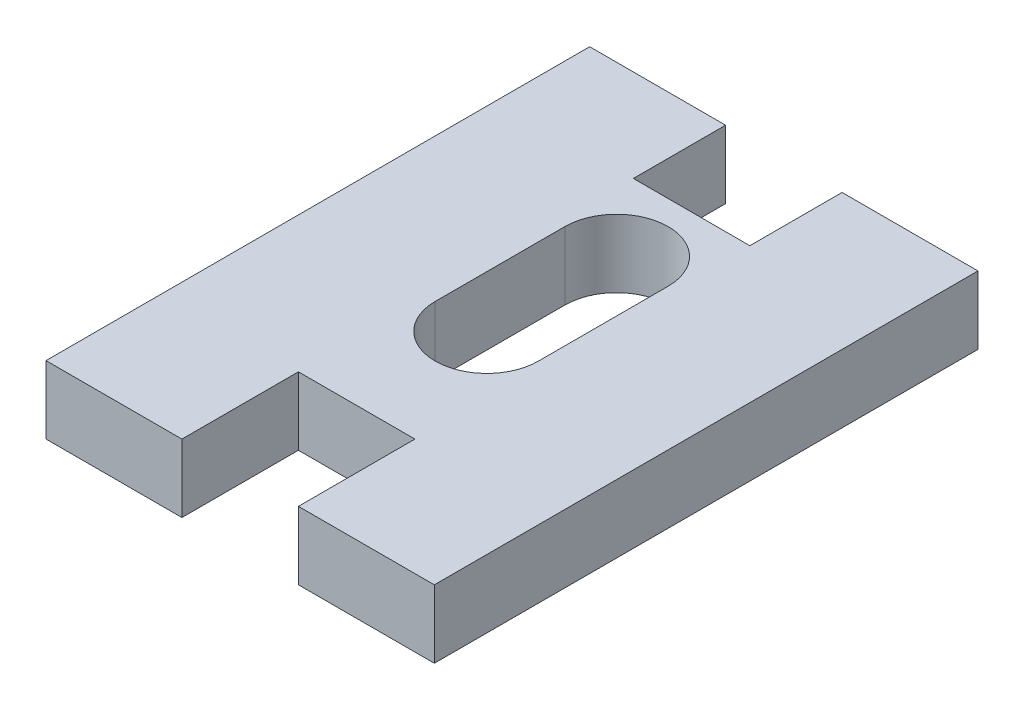
ISO-10303-21;
HEADER;
FILE_DESCRIPTION(('STEP AP214'),'2;1');
FILE_NAME('part.step','',(''),(''),'','','');
FILE_SCHEMA(('AUTOMOTIVE_DESIGN { 1 0 10303 214 1 1 1 1 }'));
ENDSEC;
DATA;
#1=APPLICATION_CONTEXT('core data for automotive mechanical design processes');
#2=APPLICATION_PROTOCOL_DEFINITION('international standard','automotive_design',2000,#1);
#3=PRODUCT_CONTEXT('',#1,'mechanical');
#4=PRODUCT('Part','Part','',(#3));
#5=PRODUCT_RELATED_PRODUCT_CATEGORY('part','',(#4));
#6=PRODUCT_DEFINITION_FORMATION('','',#4);
#7=PRODUCT_DEFINITION_CONTEXT('part definition',#1,'design');
#8=PRODUCT_DEFINITION('design','',#6,#7);
#9=PRODUCT_DEFINITION_SHAPE('','',#8);
#10=(LENGTH_UNIT() NAMED_UNIT(*) SI_UNIT(.MILLI.,.METRE.));
#11=(NAMED_UNIT(*) PLANE_ANGLE_UNIT() SI_UNIT($,.RADIAN.));
#12=(NAMED_UNIT(*) SI_UNIT($,.STERADIAN.) SOLID_ANGLE_UNIT());
#13=UNCERTAINTY_MEASURE_WITH_UNIT(LENGTH_MEASURE(1.E-05),#10,'distance_accuracy_value','');
#14=(GEOMETRIC_REPRESENTATION_CONTEXT(3) GLOBAL_UNCERTAINTY_ASSIGNED_CONTEXT((#13)) GLOBAL_UNIT_ASSIGNED_CONTEXT((#10,
#11,#12)) REPRESENTATION_CONTEXT('',''));
#15=CARTESIAN_POINT('',(0.,0.,0.));
#16=DIRECTION('',(0.,0.,1.));
#17=DIRECTION('',(1.,0.,0.));
#18=AXIS2_PLACEMENT_3D('',#15,#16,#17);
#19=CARTESIAN_POINT('',(0.,3.5,0.));
#20=DIRECTION('',(0.,0.,-1.));
#21=DIRECTION('',(-1.,0.,0.));
#22=AXIS2_PLACEMENT_3D('',#19,#20,#21);
#23=PLANE('',#22);
#24=DIRECTION('',(1.,0.,0.));
#25=VECTOR('',#24,1.);
#26=CARTESIAN_POINT('',(0.,0.,0.));
#27=LINE('',#26,#25);
#28=CARTESIAN_POINT('',(0.,0.,0.));
#29=VERTEX_POINT('',#28);
#30=CARTESIAN_POINT('',(7.,0.,0.));
#31=VERTEX_POINT('',#30);
#32=EDGE_CURVE('E297',#29,#31,#27,.T.);
#33=ORIENTED_EDGE('',*,*,#32,.T.);
#34=DIRECTION('',(0.,1.,0.));
#35=VECTOR('',#34,1.);
#36=CARTESIAN_POINT('',(7.,0.,0.));
#37=LINE('',#36,#35);
#38=CARTESIAN_POINT('',(7.,3.5,0.));
#39=VERTEX_POINT('',#38);
#40=EDGE_CURVE('E253',#31,#39,#37,.T.);
#41=ORIENTED_EDGE('',*,*,#40,.T.);
#42=DIRECTION('',(1.,0.,0.));
#43=VECTOR('',#42,1.);
#44=CARTESIAN_POINT('',(0.,3.5,0.));
#45=LINE('',#44,#43);
#46=CARTESIAN_POINT('',(0.,3.5,0.));
#47=VERTEX_POINT('',#46);
#48=EDGE_CURVE('E280',#47,#39,#45,.T.);
#49=ORIENTED_EDGE('',*,*,#48,.F.);
#50=DIRECTION('',(0.,-1.,0.));
#51=VECTOR('',#50,1.);
#52=CARTESIAN_POINT('',(0.,3.5,0.));
#53=LINE('',#52,#51);
#54=EDGE_CURVE('E11',#47,#29,#53,.T.);
#55=ORIENTED_EDGE('',*,*,#54,.T.);
#56=EDGE_LOOP('',(#33,#41,#49,#55));
#57=FACE_BOUND('',#56,.T.);
#58=ADVANCED_FACE('F39',(#57),#23,.F.);
#59=CARTESIAN_POINT('',(0.,3.5,-28.));
#60=DIRECTION('',(0.,0.,1.));
#61=DIRECTION('',(1.,0.,0.));
#62=AXIS2_PLACEMENT_3D('',#59,#60,#61);
#63=PLANE('',#62);
#64=DIRECTION('',(-1.,0.,0.));
#65=VECTOR('',#64,1.);
#66=CARTESIAN_POINT('',(0.,3.5,-28.));
#67=LINE('',#66,#65);
#68=CARTESIAN_POINT('',(7.,3.5,-28.));
#69=VERTEX_POINT('',#68);
#70=CARTESIAN_POINT('',(0.,3.5,-28.));
#71=VERTEX_POINT('',#70);
#72=EDGE_CURVE('E287',#69,#71,#67,.T.);
#73=ORIENTED_EDGE('',*,*,#72,.F.);
#74=DIRECTION('',(0.,1.,0.));
#75=VECTOR('',#74,1.);
#76=CARTESIAN_POINT('',(7.,0.,-28.));
#77=LINE('',#76,#75);
#78=CARTESIAN_POINT('',(7.,0.,-28.));
#79=VERTEX_POINT('',#78);
#80=EDGE_CURVE('E227',#79,#69,#77,.T.);
#81=ORIENTED_EDGE('',*,*,#80,.F.);
#82=DIRECTION('',(-1.,0.,0.));
#83=VECTOR('',#82,1.);
#84=CARTESIAN_POINT('',(0.,0.,-28.));
#85=LINE('',#84,#83);
#86=CARTESIAN_POINT('',(0.,0.,-28.));
#87=VERTEX_POINT('',#86);
#88=EDGE_CURVE('E304',#79,#87,#85,.T.);
#89=ORIENTED_EDGE('',*,*,#88,.T.);
#90=DIRECTION('',(0.,-1.,0.));
#91=VECTOR('',#90,1.);
#92=CARTESIAN_POINT('',(0.,3.5,-28.));
#93=LINE('',#92,#91);
#94=EDGE_CURVE('E292',#71,#87,#93,.T.);
#95=ORIENTED_EDGE('',*,*,#94,.F.);
#96=EDGE_LOOP('',(#73,#81,#89,#95));
#97=FACE_BOUND('',#96,.T.);
#98=ADVANCED_FACE('F360',(#97),#63,.F.);
#99=CARTESIAN_POINT('',(0.,3.5,0.));
#100=DIRECTION('',(1.,0.,0.));
#101=DIRECTION('',(0.,0.,-1.));
#102=AXIS2_PLACEMENT_3D('',#99,#100,#101);
#103=PLANE('',#102);
#104=DIRECTION('',(0.,0.,1.));
#105=VECTOR('',#104,1.);
#106=CARTESIAN_POINT('',(0.,0.,0.));
#107=LINE('',#106,#105);
#108=EDGE_CURVE('E230',#87,#29,#107,.T.);
#109=ORIENTED_EDGE('',*,*,#108,.T.);
#110=ORIENTED_EDGE('',*,*,#54,.F.);
#111=DIRECTION('',(0.,0.,1.));
#112=VECTOR('',#111,1.);
#113=CARTESIAN_POINT('',(0.,3.5,0.));
#114=LINE('',#113,#112);
#115=EDGE_CURVE('E274',#71,#47,#114,.T.);
#116=ORIENTED_EDGE('',*,*,#115,.F.);
#117=ORIENTED_EDGE('',*,*,#94,.T.);
#118=EDGE_LOOP('',(#109,#110,#116,#117));
#119=FACE_BOUND('',#118,.T.);
#120=ADVANCED_FACE('F41',(#119),#103,.F.);
#121=CARTESIAN_POINT('',(13.,3.5,0.));
#122=VERTEX_POINT('',#121);
#123=CARTESIAN_POINT('',(20.,3.5,0.));
#124=VERTEX_POINT('',#123);
#125=EDGE_CURVE('E278',#122,#124,#45,.T.);
#126=ORIENTED_EDGE('',*,*,#125,.F.);
#127=DIRECTION('',(0.,1.,0.));
#128=VECTOR('',#127,1.);
#129=CARTESIAN_POINT('',(13.,0.,0.));
#130=LINE('',#129,#128);
#131=CARTESIAN_POINT('',(13.,0.,0.));
#132=VERTEX_POINT('',#131);
#133=EDGE_CURVE('E268',#132,#122,#130,.T.);
#134=ORIENTED_EDGE('',*,*,#133,.F.);
#135=CARTESIAN_POINT('',(20.,0.,0.));
#136=VERTEX_POINT('',#135);
#137=EDGE_CURVE('E296',#132,#136,#27,.T.);
#138=ORIENTED_EDGE('',*,*,#137,.T.);
#139=DIRECTION('',(0.,-1.,0.));
#140=VECTOR('',#139,1.);
#141=CARTESIAN_POINT('',(20.,3.5,0.));
#142=LINE('',#141,#140);
#143=EDGE_CURVE('E48',#124,#136,#142,.T.);
#144=ORIENTED_EDGE('',*,*,#143,.F.);
#145=EDGE_LOOP('',(#126,#134,#138,#144));
#146=FACE_BOUND('',#145,.T.);
#147=ADVANCED_FACE('F339',(#146),#23,.F.);
#148=CARTESIAN_POINT('',(20.,3.5,0.));
#149=DIRECTION('',(-1.,0.,0.));
#150=DIRECTION('',(0.,0.,1.));
#151=AXIS2_PLACEMENT_3D('',#148,#149,#150);
#152=PLANE('',#151);
#153=DIRECTION('',(0.,0.,-1.));
#154=VECTOR('',#153,1.);
#155=CARTESIAN_POINT('',(20.,0.,0.));
#156=LINE('',#155,#154);
#157=CARTESIAN_POINT('',(20.,0.,-28.));
#158=VERTEX_POINT('',#157);
#159=EDGE_CURVE('E301',#136,#158,#156,.T.);
#160=ORIENTED_EDGE('',*,*,#159,.T.);
#161=DIRECTION('',(0.,-1.,0.));
#162=VECTOR('',#161,1.);
#163=CARTESIAN_POINT('',(20.,3.5,-28.));
#164=LINE('',#163,#162);
#165=CARTESIAN_POINT('',(20.,3.5,-28.));
#166=VERTEX_POINT('',#165);
#167=EDGE_CURVE('E311',#166,#158,#164,.T.);
#168=ORIENTED_EDGE('',*,*,#167,.F.);
#169=DIRECTION('',(0.,0.,-1.));
#170=VECTOR('',#169,1.);
#171=CARTESIAN_POINT('',(20.,3.5,0.));
#172=LINE('',#171,#170);
#173=EDGE_CURVE('E284',#124,#166,#172,.T.);
#174=ORIENTED_EDGE('',*,*,#173,.F.);
#175=ORIENTED_EDGE('',*,*,#143,.T.);
#176=EDGE_LOOP('',(#160,#168,#174,#175));
#177=FACE_BOUND('',#176,.T.);
#178=ADVANCED_FACE('F320',(#177),#152,.F.);
#179=CARTESIAN_POINT('',(13.,0.,-28.));
#180=VERTEX_POINT('',#179);
#181=EDGE_CURVE('E279',#158,#180,#85,.T.);
#182=ORIENTED_EDGE('',*,*,#181,.T.);
#183=DIRECTION('',(0.,1.,0.));
#184=VECTOR('',#183,1.);
#185=CARTESIAN_POINT('',(13.,0.,-28.));
#186=LINE('',#185,#184);
#187=CARTESIAN_POINT('',(13.,3.5,-28.));
#188=VERTEX_POINT('',#187);
#189=EDGE_CURVE('E231',#180,#188,#186,.T.);
#190=ORIENTED_EDGE('',*,*,#189,.T.);
#191=EDGE_CURVE('E288',#166,#188,#67,.T.);
#192=ORIENTED_EDGE('',*,*,#191,.F.);
#193=ORIENTED_EDGE('',*,*,#167,.T.);
#194=EDGE_LOOP('',(#182,#190,#192,#193));
#195=FACE_BOUND('',#194,.T.);
#196=ADVANCED_FACE('F327',(#195),#63,.F.);
#197=CARTESIAN_POINT('',(0.,3.5,0.));
#198=DIRECTION('',(0.,-1.,0.));
#199=DIRECTION('',(0.,0.,-1.));
#200=AXIS2_PLACEMENT_3D('',#197,#198,#199);
#201=PLANE('',#200);
#202=DIRECTION('',(0.,0.,1.));
#203=VECTOR('',#202,1.);
#204=CARTESIAN_POINT('',(7.38297531585007,3.5,-19.34));
#205=LINE('',#204,#203);
#206=CARTESIAN_POINT('',(7.38297531585007,3.5,-19.34));
#207=VERTEX_POINT('',#206);
#208=CARTESIAN_POINT('',(7.38297531585007,3.5,-12.66));
#209=VERTEX_POINT('',#208);
#210=EDGE_CURVE('E187',#207,#209,#205,.T.);
#211=ORIENTED_EDGE('',*,*,#210,.F.);
#212=CARTESIAN_POINT('',(10.0429753158501,3.5,-19.34));
#213=DIRECTION('',(0.,1.,0.));
#214=DIRECTION('',(0.,0.,1.));
#215=AXIS2_PLACEMENT_3D('',#212,#213,#214);
#216=CIRCLE('',#215,2.66);
#217=CARTESIAN_POINT('',(12.7029753158501,3.5,-19.34));
#218=VERTEX_POINT('',#217);
#219=EDGE_CURVE('E55',#218,#207,#216,.T.);
#220=ORIENTED_EDGE('',*,*,#219,.F.);
#221=DIRECTION('',(0.,0.,-1.));
#222=VECTOR('',#221,1.);
#223=CARTESIAN_POINT('',(12.7029753158501,3.5,-19.34));
#224=LINE('',#223,#222);
#225=CARTESIAN_POINT('',(12.7029753158501,3.5,-12.66));
#226=VERTEX_POINT('',#225);
#227=EDGE_CURVE('E174',#226,#218,#224,.T.);
#228=ORIENTED_EDGE('',*,*,#227,.F.);
#229=CARTESIAN_POINT('',(10.0429753158501,3.5,-12.66));
#230=DIRECTION('',(0.,1.,0.));
#231=DIRECTION('',(0.,0.,1.));
#232=AXIS2_PLACEMENT_3D('',#229,#230,#231);
#233=CIRCLE('',#232,2.66);
#234=EDGE_CURVE('E178',#209,#226,#233,.T.);
#235=ORIENTED_EDGE('',*,*,#234,.F.);
#236=EDGE_LOOP('',(#211,#220,#228,#235));
#237=FACE_BOUND('',#236,.T.);
#238=DIRECTION('',(1.,0.,0.));
#239=VECTOR('',#238,1.);
#240=CARTESIAN_POINT('',(7.,3.5,-23.25));
#241=LINE('',#240,#239);
#242=CARTESIAN_POINT('',(7.,3.5,-23.25));
#243=VERTEX_POINT('',#242);
#244=CARTESIAN_POINT('',(13.,3.5,-23.25));
#245=VERTEX_POINT('',#244);
#246=EDGE_CURVE('E220',#243,#245,#241,.T.);
#247=ORIENTED_EDGE('',*,*,#246,.F.);
#248=DIRECTION('',(0.,0.,1.));
#249=VECTOR('',#248,1.);
#250=CARTESIAN_POINT('',(7.,3.5,-28.));
#251=LINE('',#250,#249);
#252=EDGE_CURVE('E216',#69,#243,#251,.T.);
#253=ORIENTED_EDGE('',*,*,#252,.F.);
#254=ORIENTED_EDGE('',*,*,#72,.T.);
#255=ORIENTED_EDGE('',*,*,#115,.T.);
#256=ORIENTED_EDGE('',*,*,#48,.T.);
#257=DIRECTION('',(0.,0.,1.));
#258=VECTOR('',#257,1.);
#259=CARTESIAN_POINT('',(7.,3.5,0.));
#260=LINE('',#259,#258);
#261=CARTESIAN_POINT('',(7.,3.5,-6.));
#262=VERTEX_POINT('',#261);
#263=EDGE_CURVE('E196',#262,#39,#260,.T.);
#264=ORIENTED_EDGE('',*,*,#263,.F.);
#265=DIRECTION('',(-1.,0.,0.));
#266=VECTOR('',#265,1.);
#267=CARTESIAN_POINT('',(7.,3.5,-6.));
#268=LINE('',#267,#266);
#269=CARTESIAN_POINT('',(13.,3.5,-6.));
#270=VERTEX_POINT('',#269);
#271=EDGE_CURVE('E245',#270,#262,#268,.T.);
#272=ORIENTED_EDGE('',*,*,#271,.F.);
#273=DIRECTION('',(0.,0.,-1.));
#274=VECTOR('',#273,1.);
#275=CARTESIAN_POINT('',(13.,3.5,0.));
#276=LINE('',#275,#274);
#277=EDGE_CURVE('E256',#122,#270,#276,.T.);
#278=ORIENTED_EDGE('',*,*,#277,.F.);
#279=ORIENTED_EDGE('',*,*,#125,.T.);
#280=ORIENTED_EDGE('',*,*,#173,.T.);
#281=ORIENTED_EDGE('',*,*,#191,.T.);
#282=DIRECTION('',(0.,0.,-1.));
#283=VECTOR('',#282,1.);
#284=CARTESIAN_POINT('',(13.,3.5,-28.));
#285=LINE('',#284,#283);
#286=EDGE_CURVE('E207',#245,#188,#285,.T.);
#287=ORIENTED_EDGE('',*,*,#286,.F.);
#288=EDGE_LOOP('',(#247,#253,#254,#255,#256,#264,#272,#278,#279,#280,#281,#287));
#289=FACE_BOUND('',#288,.T.);
#290=ADVANCED_FACE('F332',(#237,#289),#201,.F.);
#291=CARTESIAN_POINT('',(0.,0.,0.));
#292=DIRECTION('',(0.,-1.,0.));
#293=DIRECTION('',(0.,0.,-1.));
#294=AXIS2_PLACEMENT_3D('',#291,#292,#293);
#295=PLANE('',#294);
#296=CARTESIAN_POINT('',(10.0429753158501,0.,-19.34));
#297=DIRECTION('',(0.,1.,0.));
#298=DIRECTION('',(0.,0.,1.));
#299=AXIS2_PLACEMENT_3D('',#296,#297,#298);
#300=CIRCLE('',#299,2.66);
#301=CARTESIAN_POINT('',(12.7029753158501,0.,-19.34));
#302=VERTEX_POINT('',#301);
#303=CARTESIAN_POINT('',(7.38297531585007,0.,-19.34));
#304=VERTEX_POINT('',#303);
#305=EDGE_CURVE('E155',#302,#304,#300,.T.);
#306=ORIENTED_EDGE('',*,*,#305,.T.);
#307=DIRECTION('',(0.,0.,1.));
#308=VECTOR('',#307,1.);
#309=CARTESIAN_POINT('',(7.38297531585007,0.,-19.34));
#310=LINE('',#309,#308);
#311=CARTESIAN_POINT('',(7.38297531585007,0.,-12.66));
#312=VERTEX_POINT('',#311);
#313=EDGE_CURVE('E165',#304,#312,#310,.T.);
#314=ORIENTED_EDGE('',*,*,#313,.T.);
#315=CARTESIAN_POINT('',(10.0429753158501,0.,-12.66));
#316=DIRECTION('',(0.,1.,0.));
#317=DIRECTION('',(0.,0.,1.));
#318=AXIS2_PLACEMENT_3D('',#315,#316,#317);
#319=CIRCLE('',#318,2.66);
#320=CARTESIAN_POINT('',(12.7029753158501,0.,-12.66));
#321=VERTEX_POINT('',#320);
#322=EDGE_CURVE('E63',#312,#321,#319,.T.);
#323=ORIENTED_EDGE('',*,*,#322,.T.);
#324=DIRECTION('',(0.,0.,-1.));
#325=VECTOR('',#324,1.);
#326=CARTESIAN_POINT('',(12.7029753158501,0.,-19.34));
#327=LINE('',#326,#325);
#328=EDGE_CURVE('E162',#321,#302,#327,.T.);
#329=ORIENTED_EDGE('',*,*,#328,.T.);
#330=EDGE_LOOP('',(#306,#314,#323,#329));
#331=FACE_BOUND('',#330,.T.);
#332=DIRECTION('',(0.,0.,1.));
#333=VECTOR('',#332,1.);
#334=CARTESIAN_POINT('',(7.,0.,-28.));
#335=LINE('',#334,#333);
#336=CARTESIAN_POINT('',(7.,0.,-23.25));
#337=VERTEX_POINT('',#336);
#338=EDGE_CURVE('E202',#79,#337,#335,.T.);
#339=ORIENTED_EDGE('',*,*,#338,.T.);
#340=DIRECTION('',(1.,0.,0.));
#341=VECTOR('',#340,1.);
#342=CARTESIAN_POINT('',(7.,0.,-23.25));
#343=LINE('',#342,#341);
#344=CARTESIAN_POINT('',(13.,0.,-23.25));
#345=VERTEX_POINT('',#344);
#346=EDGE_CURVE('E206',#337,#345,#343,.T.);
#347=ORIENTED_EDGE('',*,*,#346,.T.);
#348=DIRECTION('',(0.,0.,-1.));
#349=VECTOR('',#348,1.);
#350=CARTESIAN_POINT('',(13.,0.,-28.));
#351=LINE('',#350,#349);
#352=EDGE_CURVE('E211',#345,#180,#351,.T.);
#353=ORIENTED_EDGE('',*,*,#352,.T.);
#354=ORIENTED_EDGE('',*,*,#181,.F.);
#355=ORIENTED_EDGE('',*,*,#159,.F.);
#356=ORIENTED_EDGE('',*,*,#137,.F.);
#357=DIRECTION('',(0.,0.,-1.));
#358=VECTOR('',#357,1.);
#359=CARTESIAN_POINT('',(13.,0.,0.));
#360=LINE('',#359,#358);
#361=CARTESIAN_POINT('',(13.,0.,-6.));
#362=VERTEX_POINT('',#361);
#363=EDGE_CURVE('E244',#132,#362,#360,.T.);
#364=ORIENTED_EDGE('',*,*,#363,.T.);
#365=DIRECTION('',(-1.,0.,0.));
#366=VECTOR('',#365,1.);
#367=CARTESIAN_POINT('',(7.,0.,-6.));
#368=LINE('',#367,#366);
#369=CARTESIAN_POINT('',(7.,0.,-6.));
#370=VERTEX_POINT('',#369);
#371=EDGE_CURVE('E249',#362,#370,#368,.T.);
#372=ORIENTED_EDGE('',*,*,#371,.T.);
#373=DIRECTION('',(0.,0.,1.));
#374=VECTOR('',#373,1.);
#375=CARTESIAN_POINT('',(7.,0.,0.));
#376=LINE('',#375,#374);
#377=EDGE_CURVE('E240',#370,#31,#376,.T.);
#378=ORIENTED_EDGE('',*,*,#377,.T.);
#379=ORIENTED_EDGE('',*,*,#32,.F.);
#380=ORIENTED_EDGE('',*,*,#108,.F.);
#381=ORIENTED_EDGE('',*,*,#88,.F.);
#382=EDGE_LOOP('',(#339,#347,#353,#354,#355,#356,#364,#372,#378,#379,#380,#381));
#383=FACE_BOUND('',#382,.T.);
#384=ADVANCED_FACE('F170',(#331,#383),#295,.T.);
#385=CARTESIAN_POINT('',(7.,0.,0.));
#386=DIRECTION('',(-1.,0.,0.));
#387=DIRECTION('',(0.,0.,1.));
#388=AXIS2_PLACEMENT_3D('',#385,#386,#387);
#389=PLANE('',#388);
#390=ORIENTED_EDGE('',*,*,#263,.T.);
#391=ORIENTED_EDGE('',*,*,#40,.F.);
#392=ORIENTED_EDGE('',*,*,#377,.F.);
#393=DIRECTION('',(0.,1.,0.));
#394=VECTOR('',#393,1.);
#395=CARTESIAN_POINT('',(7.,0.,-6.));
#396=LINE('',#395,#394);
#397=EDGE_CURVE('E221',#370,#262,#396,.T.);
#398=ORIENTED_EDGE('',*,*,#397,.T.);
#399=EDGE_LOOP('',(#390,#391,#392,#398));
#400=FACE_BOUND('',#399,.T.);
#401=ADVANCED_FACE('F348',(#400),#389,.F.);
#402=CARTESIAN_POINT('',(7.,0.,-6.));
#403=DIRECTION('',(0.,0.,-1.));
#404=DIRECTION('',(-1.,0.,0.));
#405=AXIS2_PLACEMENT_3D('',#402,#403,#404);
#406=PLANE('',#405);
#407=ORIENTED_EDGE('',*,*,#271,.T.);
#408=ORIENTED_EDGE('',*,*,#397,.F.);
#409=ORIENTED_EDGE('',*,*,#371,.F.);
#410=DIRECTION('',(0.,1.,0.));
#411=VECTOR('',#410,1.);
#412=CARTESIAN_POINT('',(13.,0.,-6.));
#413=LINE('',#412,#411);
#414=EDGE_CURVE('E265',#362,#270,#413,.T.);
#415=ORIENTED_EDGE('',*,*,#414,.T.);
#416=EDGE_LOOP('',(#407,#408,#409,#415));
#417=FACE_BOUND('',#416,.T.);
#418=ADVANCED_FACE('F345',(#417),#406,.F.);
#419=CARTESIAN_POINT('',(13.,0.,0.));
#420=DIRECTION('',(1.,0.,0.));
#421=DIRECTION('',(0.,0.,-1.));
#422=AXIS2_PLACEMENT_3D('',#419,#420,#421);
#423=PLANE('',#422);
#424=ORIENTED_EDGE('',*,*,#277,.T.);
#425=ORIENTED_EDGE('',*,*,#414,.F.);
#426=ORIENTED_EDGE('',*,*,#363,.F.);
#427=ORIENTED_EDGE('',*,*,#133,.T.);
#428=EDGE_LOOP('',(#424,#425,#426,#427));
#429=FACE_BOUND('',#428,.T.);
#430=ADVANCED_FACE('F341',(#429),#423,.F.);
#431=CARTESIAN_POINT('',(7.,0.,-28.));
#432=DIRECTION('',(-1.,0.,0.));
#433=DIRECTION('',(0.,0.,1.));
#434=AXIS2_PLACEMENT_3D('',#431,#432,#433);
#435=PLANE('',#434);
#436=ORIENTED_EDGE('',*,*,#252,.T.);
#437=DIRECTION('',(0.,1.,0.));
#438=VECTOR('',#437,1.);
#439=CARTESIAN_POINT('',(7.,0.,-23.25));
#440=LINE('',#439,#438);
#441=EDGE_CURVE('E215',#337,#243,#440,.T.);
#442=ORIENTED_EDGE('',*,*,#441,.F.);
#443=ORIENTED_EDGE('',*,*,#338,.F.);
#444=ORIENTED_EDGE('',*,*,#80,.T.);
#445=EDGE_LOOP('',(#436,#442,#443,#444));
#446=FACE_BOUND('',#445,.T.);
#447=ADVANCED_FACE('F362',(#446),#435,.F.);
#448=CARTESIAN_POINT('',(13.,0.,-28.));
#449=DIRECTION('',(1.,0.,0.));
#450=DIRECTION('',(0.,0.,-1.));
#451=AXIS2_PLACEMENT_3D('',#448,#449,#450);
#452=PLANE('',#451);
#453=ORIENTED_EDGE('',*,*,#286,.T.);
#454=ORIENTED_EDGE('',*,*,#189,.F.);
#455=ORIENTED_EDGE('',*,*,#352,.F.);
#456=DIRECTION('',(0.,1.,0.));
#457=VECTOR('',#456,1.);
#458=CARTESIAN_POINT('',(13.,0.,-23.25));
#459=LINE('',#458,#457);
#460=EDGE_CURVE('E235',#345,#245,#459,.T.);
#461=ORIENTED_EDGE('',*,*,#460,.T.);
#462=EDGE_LOOP('',(#453,#454,#455,#461));
#463=FACE_BOUND('',#462,.T.);
#464=ADVANCED_FACE('F368',(#463),#452,.F.);
#465=CARTESIAN_POINT('',(7.,0.,-23.25));
#466=DIRECTION('',(0.,0.,1.));
#467=DIRECTION('',(1.,0.,0.));
#468=AXIS2_PLACEMENT_3D('',#465,#466,#467);
#469=PLANE('',#468);
#470=ORIENTED_EDGE('',*,*,#246,.T.);
#471=ORIENTED_EDGE('',*,*,#460,.F.);
#472=ORIENTED_EDGE('',*,*,#346,.F.);
#473=ORIENTED_EDGE('',*,*,#441,.T.);
#474=EDGE_LOOP('',(#470,#471,#472,#473));
#475=FACE_BOUND('',#474,.T.);
#476=ADVANCED_FACE('F365',(#475),#469,.F.);
#477=CARTESIAN_POINT('',(10.0429753158501,0.,-19.34));
#478=DIRECTION('',(0.,1.,0.));
#479=DIRECTION('',(0.,0.,1.));
#480=AXIS2_PLACEMENT_3D('',#477,#478,#479);
#481=CYLINDRICAL_SURFACE('',#480,2.66);
#482=ORIENTED_EDGE('',*,*,#219,.T.);
#483=DIRECTION('',(0.,1.,0.));
#484=VECTOR('',#483,1.);
#485=CARTESIAN_POINT('',(7.38297531585007,0.,-19.34));
#486=LINE('',#485,#484);
#487=EDGE_CURVE('E151',#304,#207,#486,.T.);
#488=ORIENTED_EDGE('',*,*,#487,.F.);
#489=ORIENTED_EDGE('',*,*,#305,.F.);
#490=DIRECTION('',(0.,1.,0.));
#491=VECTOR('',#490,1.);
#492=CARTESIAN_POINT('',(12.7029753158501,0.,-19.34));
#493=LINE('',#492,#491);
#494=EDGE_CURVE('E193',#302,#218,#493,.T.);
#495=ORIENTED_EDGE('',*,*,#494,.T.);
#496=EDGE_LOOP('',(#482,#488,#489,#495));
#497=FACE_BOUND('',#496,.T.);
#498=ADVANCED_FACE('F153',(#497),#481,.F.);
#499=CARTESIAN_POINT('',(12.7029753158501,0.,-19.34));
#500=DIRECTION('',(1.,0.,0.));
#501=DIRECTION('',(0.,0.,-1.));
#502=AXIS2_PLACEMENT_3D('',#499,#500,#501);
#503=PLANE('',#502);
#504=ORIENTED_EDGE('',*,*,#227,.T.);
#505=ORIENTED_EDGE('',*,*,#494,.F.);
#506=ORIENTED_EDGE('',*,*,#328,.F.);
#507=DIRECTION('',(0.,1.,0.));
#508=VECTOR('',#507,1.);
#509=CARTESIAN_POINT('',(12.7029753158501,0.,-12.66));
#510=LINE('',#509,#508);
#511=EDGE_CURVE('E197',#321,#226,#510,.T.);
#512=ORIENTED_EDGE('',*,*,#511,.T.);
#513=EDGE_LOOP('',(#504,#505,#506,#512));
#514=FACE_BOUND('',#513,.T.);
#515=ADVANCED_FACE('F476',(#514),#503,.F.);
#516=CARTESIAN_POINT('',(10.0429753158501,0.,-12.66));
#517=DIRECTION('',(0.,1.,0.));
#518=DIRECTION('',(0.,0.,1.));
#519=AXIS2_PLACEMENT_3D('',#516,#517,#518);
#520=CYLINDRICAL_SURFACE('',#519,2.66);
#521=ORIENTED_EDGE('',*,*,#234,.T.);
#522=ORIENTED_EDGE('',*,*,#511,.F.);
#523=ORIENTED_EDGE('',*,*,#322,.F.);
#524=DIRECTION('',(0.,1.,0.));
#525=VECTOR('',#524,1.);
#526=CARTESIAN_POINT('',(7.38297531585007,0.,-12.66));
#527=LINE('',#526,#525);
#528=EDGE_CURVE('E161',#312,#209,#527,.T.);
#529=ORIENTED_EDGE('',*,*,#528,.T.);
#530=EDGE_LOOP('',(#521,#522,#523,#529));
#531=FACE_BOUND('',#530,.T.);
#532=ADVANCED_FACE('F484',(#531),#520,.F.);
#533=CARTESIAN_POINT('',(7.38297531585007,0.,-19.34));
#534=DIRECTION('',(-1.,0.,0.));
#535=DIRECTION('',(0.,0.,1.));
#536=AXIS2_PLACEMENT_3D('',#533,#534,#535);
#537=PLANE('',#536);
#538=ORIENTED_EDGE('',*,*,#210,.T.);
#539=ORIENTED_EDGE('',*,*,#528,.F.);
#540=ORIENTED_EDGE('',*,*,#313,.F.);
#541=ORIENTED_EDGE('',*,*,#487,.T.);
#542=EDGE_LOOP('',(#538,#539,#540,#541));
#543=FACE_BOUND('',#542,.T.);
#544=ADVANCED_FACE('F166',(#543),#537,.F.);
#545=CLOSED_SHELL('',(#58,#98,#120,#147,#178,#196,#290,#384,#401,#418,#430,#447,#464,#476,#498,
#515,#532,#544));
#546=MANIFOLD_SOLID_BREP('B2',#545);
#547=ADVANCED_BREP_SHAPE_REPRESENTATION('',(#18,#546),#14);
#548=SHAPE_DEFINITION_REPRESENTATION(#9,#547);
ENDSEC;
END-ISO-10303-21;
